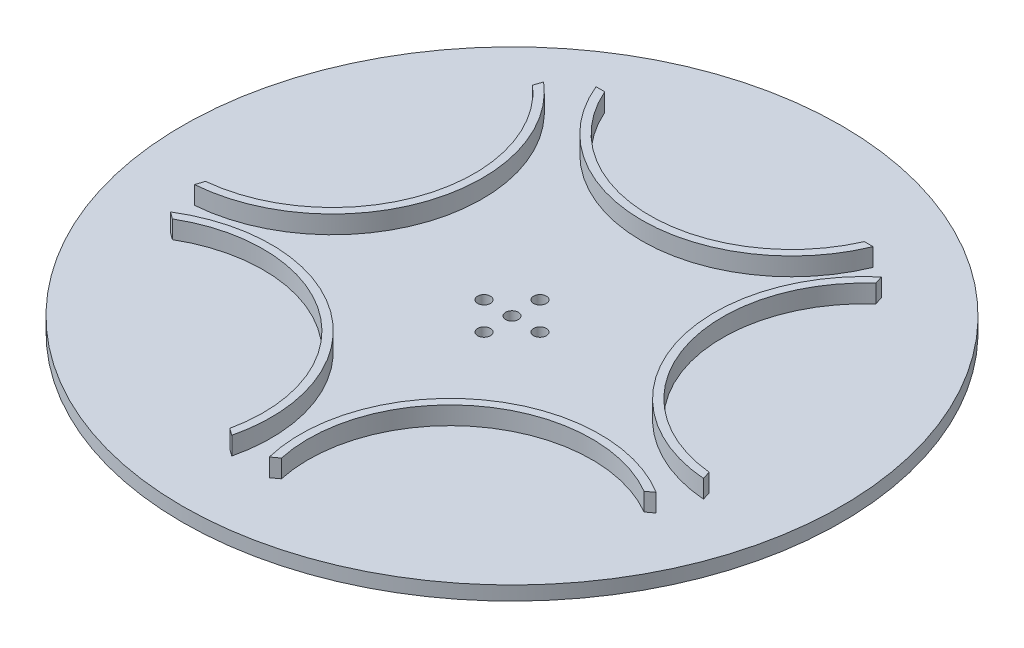
ISO-10303-21;
HEADER;
FILE_DESCRIPTION(('STEP AP214'),'2;1');
FILE_NAME('part.step','',(''),(''),'','','');
FILE_SCHEMA(('AUTOMOTIVE_DESIGN { 1 0 10303 214 1 1 1 1 }'));
ENDSEC;
DATA;
#1=APPLICATION_CONTEXT('core data for automotive mechanical design processes');
#2=APPLICATION_PROTOCOL_DEFINITION('international standard','automotive_design',2000,#1);
#3=PRODUCT_CONTEXT('',#1,'mechanical');
#4=PRODUCT('Part','Part','',(#3));
#5=PRODUCT_RELATED_PRODUCT_CATEGORY('part','',(#4));
#6=PRODUCT_DEFINITION_FORMATION('','',#4);
#7=PRODUCT_DEFINITION_CONTEXT('part definition',#1,'design');
#8=PRODUCT_DEFINITION('design','',#6,#7);
#9=PRODUCT_DEFINITION_SHAPE('','',#8);
#10=(LENGTH_UNIT() NAMED_UNIT(*) SI_UNIT(.MILLI.,.METRE.));
#11=(NAMED_UNIT(*) PLANE_ANGLE_UNIT() SI_UNIT($,.RADIAN.));
#12=(NAMED_UNIT(*) SI_UNIT($,.STERADIAN.) SOLID_ANGLE_UNIT());
#13=UNCERTAINTY_MEASURE_WITH_UNIT(LENGTH_MEASURE(1.E-05),#10,'distance_accuracy_value','');
#14=(GEOMETRIC_REPRESENTATION_CONTEXT(3) GLOBAL_UNCERTAINTY_ASSIGNED_CONTEXT((#13)) GLOBAL_UNIT_ASSIGNED_CONTEXT((#10,
#11,#12)) REPRESENTATION_CONTEXT('',''));
#15=CARTESIAN_POINT('',(0.,0.,0.));
#16=DIRECTION('',(0.,0.,1.));
#17=DIRECTION('',(1.,0.,0.));
#18=AXIS2_PLACEMENT_3D('',#15,#16,#17);
#19=CARTESIAN_POINT('',(0.,3.5,0.));
#20=DIRECTION('',(0.,-1.,0.));
#21=DIRECTION('',(0.,0.,-1.));
#22=AXIS2_PLACEMENT_3D('',#19,#20,#21);
#23=CYLINDRICAL_SURFACE('',#22,82.5);
#24=CARTESIAN_POINT('',(0.,3.5,0.));
#25=DIRECTION('',(0.,1.,0.));
#26=DIRECTION('',(0.,0.,1.));
#27=AXIS2_PLACEMENT_3D('',#24,#25,#26);
#28=CIRCLE('',#27,82.5);
#29=CARTESIAN_POINT('',(0.,3.5,82.5));
#30=VERTEX_POINT('',#29);
#31=EDGE_CURVE('E399',#30,#30,#28,.T.);
#32=ORIENTED_EDGE('',*,*,#31,.F.);
#33=EDGE_LOOP('',(#32));
#34=FACE_BOUND('',#33,.T.);
#35=CARTESIAN_POINT('',(0.,0.,0.));
#36=DIRECTION('',(0.,1.,0.));
#37=DIRECTION('',(0.,0.,1.));
#38=AXIS2_PLACEMENT_3D('',#35,#36,#37);
#39=CIRCLE('',#38,82.5);
#40=CARTESIAN_POINT('',(0.,0.,82.5));
#41=VERTEX_POINT('',#40);
#42=EDGE_CURVE('E387',#41,#41,#39,.T.);
#43=ORIENTED_EDGE('',*,*,#42,.T.);
#44=EDGE_LOOP('',(#43));
#45=FACE_BOUND('',#44,.T.);
#46=ADVANCED_FACE('F129',(#34,#45),#23,.T.);
#47=CARTESIAN_POINT('',(0.,3.5,0.));
#48=DIRECTION('',(0.,-1.,0.));
#49=DIRECTION('',(0.,0.,-1.));
#50=AXIS2_PLACEMENT_3D('',#47,#48,#49);
#51=CYLINDRICAL_SURFACE('',#50,1.6);
#52=CARTESIAN_POINT('',(0.,3.5,0.));
#53=DIRECTION('',(0.,1.,0.));
#54=DIRECTION('',(0.,0.,1.));
#55=AXIS2_PLACEMENT_3D('',#52,#53,#54);
#56=CIRCLE('',#55,1.6);
#57=CARTESIAN_POINT('',(0.,3.5,1.6));
#58=VERTEX_POINT('',#57);
#59=EDGE_CURVE('E396',#58,#58,#56,.T.);
#60=ORIENTED_EDGE('',*,*,#59,.T.);
#61=EDGE_LOOP('',(#60));
#62=FACE_BOUND('',#61,.T.);
#63=CARTESIAN_POINT('',(0.,0.,0.));
#64=DIRECTION('',(0.,1.,0.));
#65=DIRECTION('',(0.,0.,1.));
#66=AXIS2_PLACEMENT_3D('',#63,#64,#65);
#67=CIRCLE('',#66,1.6);
#68=CARTESIAN_POINT('',(0.,0.,1.6));
#69=VERTEX_POINT('',#68);
#70=EDGE_CURVE('E414',#69,#69,#67,.T.);
#71=ORIENTED_EDGE('',*,*,#70,.F.);
#72=EDGE_LOOP('',(#71));
#73=FACE_BOUND('',#72,.T.);
#74=ADVANCED_FACE('F478',(#62,#73),#51,.F.);
#75=CARTESIAN_POINT('',(0.,3.5,-7.));
#76=DIRECTION('',(0.,-1.,0.));
#77=DIRECTION('',(0.,0.,-1.));
#78=AXIS2_PLACEMENT_3D('',#75,#76,#77);
#79=CYLINDRICAL_SURFACE('',#78,1.6);
#80=CARTESIAN_POINT('',(0.,3.5,-7.));
#81=DIRECTION('',(0.,1.,0.));
#82=DIRECTION('',(0.,0.,1.));
#83=AXIS2_PLACEMENT_3D('',#80,#81,#82);
#84=CIRCLE('',#83,1.6);
#85=CARTESIAN_POINT('',(0.,3.5,-5.4));
#86=VERTEX_POINT('',#85);
#87=EDGE_CURVE('E393',#86,#86,#84,.T.);
#88=ORIENTED_EDGE('',*,*,#87,.T.);
#89=EDGE_LOOP('',(#88));
#90=FACE_BOUND('',#89,.T.);
#91=CARTESIAN_POINT('',(0.,0.,-7.));
#92=DIRECTION('',(0.,1.,0.));
#93=DIRECTION('',(0.,0.,1.));
#94=AXIS2_PLACEMENT_3D('',#91,#92,#93);
#95=CIRCLE('',#94,1.6);
#96=CARTESIAN_POINT('',(0.,0.,-5.4));
#97=VERTEX_POINT('',#96);
#98=EDGE_CURVE('E411',#97,#97,#95,.T.);
#99=ORIENTED_EDGE('',*,*,#98,.F.);
#100=EDGE_LOOP('',(#99));
#101=FACE_BOUND('',#100,.T.);
#102=ADVANCED_FACE('F484',(#90,#101),#79,.F.);
#103=CARTESIAN_POINT('',(7.,3.5,0.));
#104=DIRECTION('',(0.,-1.,0.));
#105=DIRECTION('',(0.,0.,-1.));
#106=AXIS2_PLACEMENT_3D('',#103,#104,#105);
#107=CYLINDRICAL_SURFACE('',#106,1.6);
#108=CARTESIAN_POINT('',(7.,3.5,0.));
#109=DIRECTION('',(0.,1.,0.));
#110=DIRECTION('',(0.,0.,1.));
#111=AXIS2_PLACEMENT_3D('',#108,#109,#110);
#112=CIRCLE('',#111,1.6);
#113=CARTESIAN_POINT('',(7.,3.5,1.6));
#114=VERTEX_POINT('',#113);
#115=EDGE_CURVE('E390',#114,#114,#112,.T.);
#116=ORIENTED_EDGE('',*,*,#115,.T.);
#117=EDGE_LOOP('',(#116));
#118=FACE_BOUND('',#117,.T.);
#119=CARTESIAN_POINT('',(7.,0.,0.));
#120=DIRECTION('',(0.,1.,0.));
#121=DIRECTION('',(0.,0.,1.));
#122=AXIS2_PLACEMENT_3D('',#119,#120,#121);
#123=CIRCLE('',#122,1.6);
#124=CARTESIAN_POINT('',(7.,0.,1.6));
#125=VERTEX_POINT('',#124);
#126=EDGE_CURVE('E408',#125,#125,#123,.T.);
#127=ORIENTED_EDGE('',*,*,#126,.F.);
#128=EDGE_LOOP('',(#127));
#129=FACE_BOUND('',#128,.T.);
#130=ADVANCED_FACE('F495',(#118,#129),#107,.F.);
#131=CARTESIAN_POINT('',(0.,3.5,7.));
#132=DIRECTION('',(0.,-1.,0.));
#133=DIRECTION('',(0.,0.,-1.));
#134=AXIS2_PLACEMENT_3D('',#131,#132,#133);
#135=CYLINDRICAL_SURFACE('',#134,1.6);
#136=CARTESIAN_POINT('',(0.,3.5,7.));
#137=DIRECTION('',(0.,1.,0.));
#138=DIRECTION('',(0.,0.,1.));
#139=AXIS2_PLACEMENT_3D('',#136,#137,#138);
#140=CIRCLE('',#139,1.6);
#141=CARTESIAN_POINT('',(0.,3.5,8.6));
#142=VERTEX_POINT('',#141);
#143=EDGE_CURVE('E386',#142,#142,#140,.T.);
#144=ORIENTED_EDGE('',*,*,#143,.T.);
#145=EDGE_LOOP('',(#144));
#146=FACE_BOUND('',#145,.T.);
#147=CARTESIAN_POINT('',(0.,0.,7.));
#148=DIRECTION('',(0.,1.,0.));
#149=DIRECTION('',(0.,0.,1.));
#150=AXIS2_PLACEMENT_3D('',#147,#148,#149);
#151=CIRCLE('',#150,1.6);
#152=CARTESIAN_POINT('',(0.,0.,8.6));
#153=VERTEX_POINT('',#152);
#154=EDGE_CURVE('E405',#153,#153,#151,.T.);
#155=ORIENTED_EDGE('',*,*,#154,.F.);
#156=EDGE_LOOP('',(#155));
#157=FACE_BOUND('',#156,.T.);
#158=ADVANCED_FACE('F498',(#146,#157),#135,.F.);
#159=CARTESIAN_POINT('',(-7.,3.5,0.));
#160=DIRECTION('',(0.,-1.,0.));
#161=DIRECTION('',(0.,0.,-1.));
#162=AXIS2_PLACEMENT_3D('',#159,#160,#161);
#163=CYLINDRICAL_SURFACE('',#162,1.6);
#164=CARTESIAN_POINT('',(-7.,3.5,0.));
#165=DIRECTION('',(0.,1.,0.));
#166=DIRECTION('',(0.,0.,1.));
#167=AXIS2_PLACEMENT_3D('',#164,#165,#166);
#168=CIRCLE('',#167,1.6);
#169=CARTESIAN_POINT('',(-7.,3.5,1.6));
#170=VERTEX_POINT('',#169);
#171=EDGE_CURVE('E383',#170,#170,#168,.T.);
#172=ORIENTED_EDGE('',*,*,#171,.T.);
#173=EDGE_LOOP('',(#172));
#174=FACE_BOUND('',#173,.T.);
#175=CARTESIAN_POINT('',(-7.,0.,0.));
#176=DIRECTION('',(0.,1.,0.));
#177=DIRECTION('',(0.,0.,1.));
#178=AXIS2_PLACEMENT_3D('',#175,#176,#177);
#179=CIRCLE('',#178,1.6);
#180=CARTESIAN_POINT('',(-7.,0.,1.6));
#181=VERTEX_POINT('',#180);
#182=EDGE_CURVE('E382',#181,#181,#179,.T.);
#183=ORIENTED_EDGE('',*,*,#182,.F.);
#184=EDGE_LOOP('',(#183));
#185=FACE_BOUND('',#184,.T.);
#186=ADVANCED_FACE('F131',(#174,#185),#163,.F.);
#187=CARTESIAN_POINT('',(0.,0.,0.));
#188=DIRECTION('',(0.,1.,0.));
#189=DIRECTION('',(0.,0.,1.));
#190=AXIS2_PLACEMENT_3D('',#187,#188,#189);
#191=PLANE('',#190);
#192=ORIENTED_EDGE('',*,*,#182,.T.);
#193=EDGE_LOOP('',(#192));
#194=FACE_BOUND('',#193,.T.);
#195=ORIENTED_EDGE('',*,*,#154,.T.);
#196=EDGE_LOOP('',(#195));
#197=FACE_BOUND('',#196,.T.);
#198=ORIENTED_EDGE('',*,*,#126,.T.);
#199=EDGE_LOOP('',(#198));
#200=FACE_BOUND('',#199,.T.);
#201=ORIENTED_EDGE('',*,*,#98,.T.);
#202=EDGE_LOOP('',(#201));
#203=FACE_BOUND('',#202,.T.);
#204=ORIENTED_EDGE('',*,*,#70,.T.);
#205=EDGE_LOOP('',(#204));
#206=FACE_BOUND('',#205,.T.);
#207=ORIENTED_EDGE('',*,*,#42,.F.);
#208=EDGE_LOOP('',(#207));
#209=FACE_BOUND('',#208,.T.);
#210=ADVANCED_FACE('F490',(#194,#197,#200,#203,#206,#209),#191,.F.);
#211=CARTESIAN_POINT('',(0.,3.5,0.));
#212=DIRECTION('',(0.,1.,0.));
#213=DIRECTION('',(0.,0.,1.));
#214=AXIS2_PLACEMENT_3D('',#211,#212,#213);
#215=PLANE('',#214);
#216=CARTESIAN_POINT('',(0.,3.5,-70.));
#217=DIRECTION('',(0.,1.,0.));
#218=DIRECTION('',(0.,0.,1.));
#219=AXIS2_PLACEMENT_3D('',#216,#217,#218);
#220=CIRCLE('',#219,37.5);
#221=CARTESIAN_POINT('',(34.6734768951716,3.5,-55.7171431429143));
#222=VERTEX_POINT('',#221);
#223=CARTESIAN_POINT('',(-34.6734768951716,3.5,-55.7171431429144));
#224=VERTEX_POINT('',#223);
#225=EDGE_CURVE('E137',#222,#224,#220,.F.);
#226=ORIENTED_EDGE('',*,*,#225,.T.);
#227=DIRECTION('',(1.,0.,0.));
#228=VECTOR('',#227,1.);
#229=CARTESIAN_POINT('',(0.,3.5,-55.7171431429143));
#230=LINE('',#229,#228);
#231=CARTESIAN_POINT('',(-32.5,3.5,-55.7171431429143));
#232=VERTEX_POINT('',#231);
#233=EDGE_CURVE('E12',#224,#232,#230,.T.);
#234=ORIENTED_EDGE('',*,*,#233,.T.);
#235=CARTESIAN_POINT('',(0.,3.5,-70.));
#236=DIRECTION('',(0.,1.,0.));
#237=DIRECTION('',(0.,0.,1.));
#238=AXIS2_PLACEMENT_3D('',#235,#236,#237);
#239=CIRCLE('',#238,35.5);
#240=CARTESIAN_POINT('',(32.5,3.5,-55.7171431429143));
#241=VERTEX_POINT('',#240);
#242=EDGE_CURVE('E269',#241,#232,#239,.F.);
#243=ORIENTED_EDGE('',*,*,#242,.F.);
#244=DIRECTION('',(-1.,0.,0.));
#245=VECTOR('',#244,1.);
#246=CARTESIAN_POINT('',(0.,3.5,-55.7171431429143));
#247=LINE('',#246,#245);
#248=EDGE_CURVE('E147',#222,#241,#247,.T.);
#249=ORIENTED_EDGE('',*,*,#248,.F.);
#250=EDGE_LOOP('',(#226,#234,#243,#249));
#251=FACE_BOUND('',#250,.T.);
#252=CARTESIAN_POINT('',(66.5739561406615,3.5,-21.6311896062442));
#253=DIRECTION('',(0.,1.,0.));
#254=DIRECTION('',(0.,0.,1.));
#255=AXIS2_PLACEMENT_3D('',#252,#253,#254);
#256=CIRCLE('',#255,37.5);
#257=CARTESIAN_POINT('',(63.7048456700931,3.5,15.7588920345824));
#258=VERTEX_POINT('',#257);
#259=CARTESIAN_POINT('',(42.275458440745,3.5,-50.1939802529432));
#260=VERTEX_POINT('',#259);
#261=EDGE_CURVE('E454',#258,#260,#256,.F.);
#262=ORIENTED_EDGE('',*,*,#261,.T.);
#263=DIRECTION('',(0.309016994374918,0.,0.951056516295163));
#264=VECTOR('',#263,1.);
#265=CARTESIAN_POINT('',(52.9901520554191,3.5,-17.2175441091805));
#266=LINE('',#265,#264);
#267=CARTESIAN_POINT('',(42.9470997382343,3.5,-48.1268808887732));
#268=VERTEX_POINT('',#267);
#269=EDGE_CURVE('E456',#260,#268,#266,.T.);
#270=ORIENTED_EDGE('',*,*,#269,.T.);
#271=CARTESIAN_POINT('',(66.5739561406615,3.5,-21.6311896062442));
#272=DIRECTION('',(0.,1.,0.));
#273=DIRECTION('',(0.,0.,1.));
#274=AXIS2_PLACEMENT_3D('',#271,#272,#273);
#275=CIRCLE('',#274,35.5);
#276=CARTESIAN_POINT('',(63.0332043726039,3.5,13.6917926704124));
#277=VERTEX_POINT('',#276);
#278=EDGE_CURVE('E448',#277,#268,#275,.F.);
#279=ORIENTED_EDGE('',*,*,#278,.F.);
#280=DIRECTION('',(-0.309016994374915,0.,-0.951056516295164));
#281=VECTOR('',#280,1.);
#282=CARTESIAN_POINT('',(52.9901520554192,3.5,-17.2175441091803));
#283=LINE('',#282,#281);
#284=EDGE_CURVE('E451',#258,#277,#283,.T.);
#285=ORIENTED_EDGE('',*,*,#284,.F.);
#286=EDGE_LOOP('',(#262,#270,#279,#285));
#287=FACE_BOUND('',#286,.T.);
#288=CARTESIAN_POINT('',(-41.1449676604785,3.5,56.6311896062424));
#289=DIRECTION('',(0.,1.,0.));
#290=DIRECTION('',(0.,0.,1.));
#291=AXIS2_PLACEMENT_3D('',#288,#289,#290);
#292=CIRCLE('',#291,37.5);
#293=CARTESIAN_POINT('',(-60.801147101537,3.5,24.6955573159478));
#294=VERTEX_POINT('',#293);
#295=CARTESIAN_POINT('',(-4.69828297701909,3.5,65.4566740453245));
#296=VERTEX_POINT('',#295);
#297=EDGE_CURVE('E444',#294,#296,#292,.F.);
#298=ORIENTED_EDGE('',*,*,#297,.T.);
#299=DIRECTION('',(-0.809016994374889,0.,-0.587785252292554));
#300=VECTOR('',#299,1.);
#301=CARTESIAN_POINT('',(-32.7497150392781,3.5,45.0761156806359));
#302=LINE('',#301,#300);
#303=CARTESIAN_POINT('',(-6.4566627220941,3.5,64.179136380144));
#304=VERTEX_POINT('',#303);
#305=EDGE_CURVE('E446',#296,#304,#302,.T.);
#306=ORIENTED_EDGE('',*,*,#305,.T.);
#307=CARTESIAN_POINT('',(-41.1449676604785,3.5,56.6311896062424));
#308=DIRECTION('',(0.,1.,0.));
#309=DIRECTION('',(0.,0.,1.));
#310=AXIS2_PLACEMENT_3D('',#307,#308,#309);
#311=CIRCLE('',#310,35.5);
#312=CARTESIAN_POINT('',(-59.042767356462,3.5,25.9730949811282));
#313=VERTEX_POINT('',#312);
#314=EDGE_CURVE('E438',#313,#304,#311,.F.);
#315=ORIENTED_EDGE('',*,*,#314,.F.);
#316=DIRECTION('',(0.80901699437489,0.,0.587785252292552));
#317=VECTOR('',#316,1.);
#318=CARTESIAN_POINT('',(-32.7497150392782,3.5,45.0761156806361));
#319=LINE('',#318,#317);
#320=EDGE_CURVE('E441',#294,#313,#319,.T.);
#321=ORIENTED_EDGE('',*,*,#320,.F.);
#322=EDGE_LOOP('',(#298,#306,#315,#321));
#323=FACE_BOUND('',#322,.T.);
#324=CARTESIAN_POINT('',(-66.573956140658,3.5,-21.6311896062548));
#325=DIRECTION('',(0.,1.,0.));
#326=DIRECTION('',(0.,0.,1.));
#327=AXIS2_PLACEMENT_3D('',#324,#325,#326);
#328=CIRCLE('',#327,37.5);
#329=CARTESIAN_POINT('',(-42.275458440737,3.5,-50.1939802529499));
#330=VERTEX_POINT('',#329);
#331=CARTESIAN_POINT('',(-63.7048456700956,3.5,15.7588920345722));
#332=VERTEX_POINT('',#331);
#333=EDGE_CURVE('E434',#330,#332,#328,.F.);
#334=ORIENTED_EDGE('',*,*,#333,.T.);
#335=DIRECTION('',(0.309016994375062,0.,-0.951056516295116));
#336=VECTOR('',#335,1.);
#337=CARTESIAN_POINT('',(-52.9901520554166,3.5,-17.2175441091886));
#338=LINE('',#337,#336);
#339=CARTESIAN_POINT('',(-63.0332043726061,3.5,13.6917926704024));
#340=VERTEX_POINT('',#339);
#341=EDGE_CURVE('E436',#332,#340,#338,.T.);
#342=ORIENTED_EDGE('',*,*,#341,.T.);
#343=CARTESIAN_POINT('',(-66.573956140658,3.5,-21.6311896062548));
#344=DIRECTION('',(0.,1.,0.));
#345=DIRECTION('',(0.,0.,1.));
#346=AXIS2_PLACEMENT_3D('',#343,#344,#345);
#347=CIRCLE('',#346,35.5);
#348=CARTESIAN_POINT('',(-42.9470997382266,3.5,-48.1268808887801));
#349=VERTEX_POINT('',#348);
#350=EDGE_CURVE('E428',#349,#340,#347,.F.);
#351=ORIENTED_EDGE('',*,*,#350,.F.);
#352=DIRECTION('',(-0.309016994375071,0.,0.951056516295113));
#353=VECTOR('',#352,1.);
#354=CARTESIAN_POINT('',(-52.9901520554163,3.5,-17.217544109189));
#355=LINE('',#354,#353);
#356=EDGE_CURVE('E431',#330,#349,#355,.T.);
#357=ORIENTED_EDGE('',*,*,#356,.F.);
#358=EDGE_LOOP('',(#334,#342,#351,#357));
#359=FACE_BOUND('',#358,.T.);
#360=CARTESIAN_POINT('',(41.1449676604695,3.5,56.631189606249));
#361=DIRECTION('',(0.,1.,0.));
#362=DIRECTION('',(0.,0.,1.));
#363=AXIS2_PLACEMENT_3D('',#360,#361,#362);
#364=CIRCLE('',#363,35.5);
#365=CARTESIAN_POINT('',(6.45666272208386,3.5,64.1791363801451));
#366=VERTEX_POINT('',#365);
#367=CARTESIAN_POINT('',(59.0427673564579,3.5,25.9730949811377));
#368=VERTEX_POINT('',#367);
#369=EDGE_CURVE('E425',#366,#368,#364,.F.);
#370=ORIENTED_EDGE('',*,*,#369,.F.);
#371=DIRECTION('',(0.809016994374988,0.,-0.587785252292417));
#372=VECTOR('',#371,1.);
#373=CARTESIAN_POINT('',(32.7497150392707,3.5,45.0761156806417));
#374=LINE('',#373,#372);
#375=CARTESIAN_POINT('',(4.69828297700864,3.5,65.4566740453253));
#376=VERTEX_POINT('',#375);
#377=EDGE_CURVE('E402',#376,#366,#374,.T.);
#378=ORIENTED_EDGE('',*,*,#377,.F.);
#379=CARTESIAN_POINT('',(41.1449676604695,3.5,56.631189606249));
#380=DIRECTION('',(0.,1.,0.));
#381=DIRECTION('',(0.,0.,1.));
#382=AXIS2_PLACEMENT_3D('',#379,#380,#381);
#383=CIRCLE('',#382,37.5);
#384=CARTESIAN_POINT('',(60.8011471015331,3.5,24.6955573159575));
#385=VERTEX_POINT('',#384);
#386=EDGE_CURVE('E421',#376,#385,#383,.F.);
#387=ORIENTED_EDGE('',*,*,#386,.T.);
#388=DIRECTION('',(-0.809016994374985,0.,0.587785252292422));
#389=VECTOR('',#388,1.);
#390=CARTESIAN_POINT('',(32.7497150392709,3.5,45.0761156806414));
#391=LINE('',#390,#389);
#392=EDGE_CURVE('E423',#385,#368,#391,.T.);
#393=ORIENTED_EDGE('',*,*,#392,.T.);
#394=EDGE_LOOP('',(#370,#378,#387,#393));
#395=FACE_BOUND('',#394,.T.);
#396=ORIENTED_EDGE('',*,*,#171,.F.);
#397=EDGE_LOOP('',(#396));
#398=FACE_BOUND('',#397,.T.);
#399=ORIENTED_EDGE('',*,*,#143,.F.);
#400=EDGE_LOOP('',(#399));
#401=FACE_BOUND('',#400,.T.);
#402=ORIENTED_EDGE('',*,*,#115,.F.);
#403=EDGE_LOOP('',(#402));
#404=FACE_BOUND('',#403,.T.);
#405=ORIENTED_EDGE('',*,*,#87,.F.);
#406=EDGE_LOOP('',(#405));
#407=FACE_BOUND('',#406,.T.);
#408=ORIENTED_EDGE('',*,*,#59,.F.);
#409=EDGE_LOOP('',(#408));
#410=FACE_BOUND('',#409,.T.);
#411=ORIENTED_EDGE('',*,*,#31,.T.);
#412=EDGE_LOOP('',(#411));
#413=FACE_BOUND('',#412,.T.);
#414=ADVANCED_FACE('F512',(#251,#287,#323,#359,#395,#398,#401,#404,#407,#410,#413),#215,.T.);
#415=CARTESIAN_POINT('',(41.1449676604695,8.,56.631189606249));
#416=DIRECTION('',(0.,-1.,0.));
#417=DIRECTION('',(0.,0.,-1.));
#418=AXIS2_PLACEMENT_3D('',#415,#416,#417);
#419=CYLINDRICAL_SURFACE('',#418,35.5);
#420=DIRECTION('',(0.,-1.,0.));
#421=VECTOR('',#420,1.);
#422=CARTESIAN_POINT('',(6.45666272208386,8.,64.1791363801451));
#423=LINE('',#422,#421);
#424=CARTESIAN_POINT('',(6.45666272208386,8.,64.1791363801451));
#425=VERTEX_POINT('',#424);
#426=EDGE_CURVE('E370',#425,#366,#423,.T.);
#427=ORIENTED_EDGE('',*,*,#426,.T.);
#428=ORIENTED_EDGE('',*,*,#369,.T.);
#429=DIRECTION('',(0.,-1.,0.));
#430=VECTOR('',#429,1.);
#431=CARTESIAN_POINT('',(59.0427673564579,8.,25.9730949811377));
#432=LINE('',#431,#430);
#433=CARTESIAN_POINT('',(59.0427673564579,8.,25.9730949811377));
#434=VERTEX_POINT('',#433);
#435=EDGE_CURVE('E379',#434,#368,#432,.T.);
#436=ORIENTED_EDGE('',*,*,#435,.F.);
#437=CARTESIAN_POINT('',(41.1449676604695,8.,56.631189606249));
#438=DIRECTION('',(0.,1.,0.));
#439=DIRECTION('',(0.,0.,1.));
#440=AXIS2_PLACEMENT_3D('',#437,#438,#439);
#441=CIRCLE('',#440,35.5);
#442=EDGE_CURVE('E360',#434,#425,#441,.T.);
#443=ORIENTED_EDGE('',*,*,#442,.T.);
#444=EDGE_LOOP('',(#427,#428,#436,#443));
#445=FACE_BOUND('',#444,.T.);
#446=ADVANCED_FACE('F527',(#445),#419,.F.);
#447=CARTESIAN_POINT('',(32.7497150392709,8.,45.0761156806414));
#448=DIRECTION('',(-0.587785252292422,0.,-0.809016994374985));
#449=DIRECTION('',(-0.809016994374985,0.,0.587785252292422));
#450=AXIS2_PLACEMENT_3D('',#447,#448,#449);
#451=PLANE('',#450);
#452=ORIENTED_EDGE('',*,*,#392,.F.);
#453=DIRECTION('',(0.,-1.,0.));
#454=VECTOR('',#453,1.);
#455=CARTESIAN_POINT('',(60.8011471015331,8.,24.6955573159575));
#456=LINE('',#455,#454);
#457=CARTESIAN_POINT('',(60.8011471015331,8.,24.6955573159575));
#458=VERTEX_POINT('',#457);
#459=EDGE_CURVE('E376',#458,#385,#456,.T.);
#460=ORIENTED_EDGE('',*,*,#459,.F.);
#461=DIRECTION('',(0.809016994374985,0.,-0.587785252292422));
#462=VECTOR('',#461,1.);
#463=CARTESIAN_POINT('',(32.7497150392709,8.,45.0761156806414));
#464=LINE('',#463,#462);
#465=EDGE_CURVE('E363',#434,#458,#464,.T.);
#466=ORIENTED_EDGE('',*,*,#465,.F.);
#467=ORIENTED_EDGE('',*,*,#435,.T.);
#468=EDGE_LOOP('',(#452,#460,#466,#467));
#469=FACE_BOUND('',#468,.T.);
#470=ADVANCED_FACE('F533',(#469),#451,.F.);
#471=CARTESIAN_POINT('',(41.1449676604695,8.,56.631189606249));
#472=DIRECTION('',(0.,-1.,0.));
#473=DIRECTION('',(0.,0.,-1.));
#474=AXIS2_PLACEMENT_3D('',#471,#472,#473);
#475=CYLINDRICAL_SURFACE('',#474,37.5);
#476=ORIENTED_EDGE('',*,*,#386,.F.);
#477=DIRECTION('',(0.,-1.,0.));
#478=VECTOR('',#477,1.);
#479=CARTESIAN_POINT('',(4.69828297700865,8.,65.4566740453252));
#480=LINE('',#479,#478);
#481=CARTESIAN_POINT('',(4.69828297700865,8.,65.4566740453252));
#482=VERTEX_POINT('',#481);
#483=EDGE_CURVE('E373',#482,#376,#480,.T.);
#484=ORIENTED_EDGE('',*,*,#483,.F.);
#485=CARTESIAN_POINT('',(41.1449676604695,8.,56.631189606249));
#486=DIRECTION('',(0.,1.,0.));
#487=DIRECTION('',(0.,0.,1.));
#488=AXIS2_PLACEMENT_3D('',#485,#486,#487);
#489=CIRCLE('',#488,37.5);
#490=EDGE_CURVE('E365',#458,#482,#489,.T.);
#491=ORIENTED_EDGE('',*,*,#490,.F.);
#492=ORIENTED_EDGE('',*,*,#459,.T.);
#493=EDGE_LOOP('',(#476,#484,#491,#492));
#494=FACE_BOUND('',#493,.T.);
#495=ADVANCED_FACE('F540',(#494),#475,.T.);
#496=CARTESIAN_POINT('',(32.7497150392707,8.,45.0761156806417));
#497=DIRECTION('',(0.587785252292417,0.,0.809016994374988));
#498=DIRECTION('',(0.809016994374988,0.,-0.587785252292417));
#499=AXIS2_PLACEMENT_3D('',#496,#497,#498);
#500=PLANE('',#499);
#501=ORIENTED_EDGE('',*,*,#483,.T.);
#502=ORIENTED_EDGE('',*,*,#377,.T.);
#503=ORIENTED_EDGE('',*,*,#426,.F.);
#504=DIRECTION('',(-0.809016994374988,0.,0.587785252292417));
#505=VECTOR('',#504,1.);
#506=CARTESIAN_POINT('',(32.7497150392707,8.,45.0761156806417));
#507=LINE('',#506,#505);
#508=EDGE_CURVE('E367',#425,#482,#507,.T.);
#509=ORIENTED_EDGE('',*,*,#508,.T.);
#510=EDGE_LOOP('',(#501,#502,#503,#509));
#511=FACE_BOUND('',#510,.T.);
#512=ADVANCED_FACE('F544',(#511),#500,.T.);
#513=CARTESIAN_POINT('',(0.,8.,0.));
#514=DIRECTION('',(0.,1.,0.));
#515=DIRECTION('',(0.,0.,1.));
#516=AXIS2_PLACEMENT_3D('',#513,#514,#515);
#517=PLANE('',#516);
#518=ORIENTED_EDGE('',*,*,#442,.F.);
#519=ORIENTED_EDGE('',*,*,#465,.T.);
#520=ORIENTED_EDGE('',*,*,#490,.T.);
#521=ORIENTED_EDGE('',*,*,#508,.F.);
#522=EDGE_LOOP('',(#518,#519,#520,#521));
#523=FACE_BOUND('',#522,.T.);
#524=ADVANCED_FACE('F548',(#523),#517,.T.);
#525=CARTESIAN_POINT('',(-63.0332043726061,8.,13.6917926704024));
#526=DIRECTION('',(0.951056516295116,0.,0.309016994375062));
#527=DIRECTION('',(0.309016994375062,0.,-0.951056516295116));
#528=AXIS2_PLACEMENT_3D('',#525,#526,#527);
#529=PLANE('',#528);
#530=ORIENTED_EDGE('',*,*,#341,.F.);
#531=DIRECTION('',(0.,-1.,0.));
#532=VECTOR('',#531,1.);
#533=CARTESIAN_POINT('',(-63.7048456700956,8.,15.7588920345722));
#534=LINE('',#533,#532);
#535=CARTESIAN_POINT('',(-63.7048456700956,8.,15.7588920345722));
#536=VERTEX_POINT('',#535);
#537=EDGE_CURVE('E337',#536,#332,#534,.T.);
#538=ORIENTED_EDGE('',*,*,#537,.F.);
#539=DIRECTION('',(-0.309016994375062,0.,0.951056516295116));
#540=VECTOR('',#539,1.);
#541=CARTESIAN_POINT('',(-63.0332043726061,8.,13.6917926704024));
#542=LINE('',#541,#540);
#543=CARTESIAN_POINT('',(-63.0332043726061,8.,13.6917926704024));
#544=VERTEX_POINT('',#543);
#545=EDGE_CURVE('E357',#544,#536,#542,.T.);
#546=ORIENTED_EDGE('',*,*,#545,.F.);
#547=DIRECTION('',(0.,-1.,0.));
#548=VECTOR('',#547,1.);
#549=CARTESIAN_POINT('',(-63.0332043726061,8.,13.6917926704024));
#550=LINE('',#549,#548);
#551=EDGE_CURVE('E346',#544,#340,#550,.T.);
#552=ORIENTED_EDGE('',*,*,#551,.T.);
#553=EDGE_LOOP('',(#530,#538,#546,#552));
#554=FACE_BOUND('',#553,.T.);
#555=ADVANCED_FACE('F552',(#554),#529,.F.);
#556=CARTESIAN_POINT('',(-66.573956140658,8.,-21.6311896062548));
#557=DIRECTION('',(0.,-1.,0.));
#558=DIRECTION('',(0.,0.,-1.));
#559=AXIS2_PLACEMENT_3D('',#556,#557,#558);
#560=CYLINDRICAL_SURFACE('',#559,37.5);
#561=ORIENTED_EDGE('',*,*,#333,.F.);
#562=DIRECTION('',(0.,-1.,0.));
#563=VECTOR('',#562,1.);
#564=CARTESIAN_POINT('',(-42.275458440737,8.,-50.1939802529499));
#565=LINE('',#564,#563);
#566=CARTESIAN_POINT('',(-42.275458440737,8.,-50.1939802529499));
#567=VERTEX_POINT('',#566);
#568=EDGE_CURVE('E340',#567,#330,#565,.T.);
#569=ORIENTED_EDGE('',*,*,#568,.F.);
#570=CARTESIAN_POINT('',(-66.573956140658,8.,-21.6311896062548));
#571=DIRECTION('',(0.,1.,0.));
#572=DIRECTION('',(0.,0.,1.));
#573=AXIS2_PLACEMENT_3D('',#570,#571,#572);
#574=CIRCLE('',#573,37.5);
#575=EDGE_CURVE('E355',#536,#567,#574,.T.);
#576=ORIENTED_EDGE('',*,*,#575,.F.);
#577=ORIENTED_EDGE('',*,*,#537,.T.);
#578=EDGE_LOOP('',(#561,#569,#576,#577));
#579=FACE_BOUND('',#578,.T.);
#580=ADVANCED_FACE('F566',(#579),#560,.T.);
#581=CARTESIAN_POINT('',(-42.9470997382266,8.,-48.1268808887801));
#582=DIRECTION('',(-0.951056516295113,0.,-0.309016994375071));
#583=DIRECTION('',(-0.309016994375071,0.,0.951056516295113));
#584=AXIS2_PLACEMENT_3D('',#581,#582,#583);
#585=PLANE('',#584);
#586=ORIENTED_EDGE('',*,*,#568,.T.);
#587=ORIENTED_EDGE('',*,*,#356,.T.);
#588=DIRECTION('',(0.,-1.,0.));
#589=VECTOR('',#588,1.);
#590=CARTESIAN_POINT('',(-42.9470997382266,8.,-48.1268808887801));
#591=LINE('',#590,#589);
#592=CARTESIAN_POINT('',(-42.9470997382266,8.,-48.1268808887801));
#593=VERTEX_POINT('',#592);
#594=EDGE_CURVE('E343',#593,#349,#591,.T.);
#595=ORIENTED_EDGE('',*,*,#594,.F.);
#596=DIRECTION('',(0.309016994375071,0.,-0.951056516295113));
#597=VECTOR('',#596,1.);
#598=CARTESIAN_POINT('',(-42.9470997382266,8.,-48.1268808887801));
#599=LINE('',#598,#597);
#600=EDGE_CURVE('E352',#593,#567,#599,.T.);
#601=ORIENTED_EDGE('',*,*,#600,.T.);
#602=EDGE_LOOP('',(#586,#587,#595,#601));
#603=FACE_BOUND('',#602,.T.);
#604=ADVANCED_FACE('F562',(#603),#585,.T.);
#605=CARTESIAN_POINT('',(-66.573956140658,8.,-21.6311896062548));
#606=DIRECTION('',(0.,-1.,0.));
#607=DIRECTION('',(0.,0.,-1.));
#608=AXIS2_PLACEMENT_3D('',#605,#606,#607);
#609=CYLINDRICAL_SURFACE('',#608,35.5);
#610=ORIENTED_EDGE('',*,*,#594,.T.);
#611=ORIENTED_EDGE('',*,*,#350,.T.);
#612=ORIENTED_EDGE('',*,*,#551,.F.);
#613=CARTESIAN_POINT('',(-66.573956140658,8.,-21.6311896062548));
#614=DIRECTION('',(0.,1.,0.));
#615=DIRECTION('',(0.,0.,1.));
#616=AXIS2_PLACEMENT_3D('',#613,#614,#615);
#617=CIRCLE('',#616,35.5);
#618=EDGE_CURVE('E349',#544,#593,#617,.T.);
#619=ORIENTED_EDGE('',*,*,#618,.T.);
#620=EDGE_LOOP('',(#610,#611,#612,#619));
#621=FACE_BOUND('',#620,.T.);
#622=ADVANCED_FACE('F558',(#621),#609,.F.);
#623=CARTESIAN_POINT('',(-66.573956140658,8.,-21.6311896062548));
#624=DIRECTION('',(0.,1.,0.));
#625=DIRECTION('',(0.,0.,1.));
#626=AXIS2_PLACEMENT_3D('',#623,#624,#625);
#627=PLANE('',#626);
#628=ORIENTED_EDGE('',*,*,#545,.T.);
#629=ORIENTED_EDGE('',*,*,#575,.T.);
#630=ORIENTED_EDGE('',*,*,#600,.F.);
#631=ORIENTED_EDGE('',*,*,#618,.F.);
#632=EDGE_LOOP('',(#628,#629,#630,#631));
#633=FACE_BOUND('',#632,.T.);
#634=ADVANCED_FACE('F554',(#633),#627,.T.);
#635=CARTESIAN_POINT('',(-6.45666272209409,8.,64.179136380144));
#636=DIRECTION('',(0.587785252292553,0.,-0.809016994374889));
#637=DIRECTION('',(-0.809016994374889,0.,-0.587785252292554));
#638=AXIS2_PLACEMENT_3D('',#635,#636,#637);
#639=PLANE('',#638);
#640=ORIENTED_EDGE('',*,*,#305,.F.);
#641=DIRECTION('',(0.,-1.,0.));
#642=VECTOR('',#641,1.);
#643=CARTESIAN_POINT('',(-4.69828297701909,8.,65.4566740453245));
#644=LINE('',#643,#642);
#645=CARTESIAN_POINT('',(-4.69828297701909,8.,65.4566740453245));
#646=VERTEX_POINT('',#645);
#647=EDGE_CURVE('E314',#646,#296,#644,.T.);
#648=ORIENTED_EDGE('',*,*,#647,.F.);
#649=DIRECTION('',(0.809016994374889,0.,0.587785252292553));
#650=VECTOR('',#649,1.);
#651=CARTESIAN_POINT('',(-6.45666272209409,8.,64.179136380144));
#652=LINE('',#651,#650);
#653=CARTESIAN_POINT('',(-6.4566627220941,8.,64.179136380144));
#654=VERTEX_POINT('',#653);
#655=EDGE_CURVE('E334',#654,#646,#652,.T.);
#656=ORIENTED_EDGE('',*,*,#655,.F.);
#657=DIRECTION('',(0.,-1.,0.));
#658=VECTOR('',#657,1.);
#659=CARTESIAN_POINT('',(-6.4566627220941,8.,64.179136380144));
#660=LINE('',#659,#658);
#661=EDGE_CURVE('E323',#654,#304,#660,.T.);
#662=ORIENTED_EDGE('',*,*,#661,.T.);
#663=EDGE_LOOP('',(#640,#648,#656,#662));
#664=FACE_BOUND('',#663,.T.);
#665=ADVANCED_FACE('F557',(#664),#639,.F.);
#666=CARTESIAN_POINT('',(-41.1449676604785,8.,56.6311896062424));
#667=DIRECTION('',(0.,-1.,0.));
#668=DIRECTION('',(0.,0.,-1.));
#669=AXIS2_PLACEMENT_3D('',#666,#667,#668);
#670=CYLINDRICAL_SURFACE('',#669,37.5);
#671=ORIENTED_EDGE('',*,*,#297,.F.);
#672=DIRECTION('',(0.,-1.,0.));
#673=VECTOR('',#672,1.);
#674=CARTESIAN_POINT('',(-60.801147101537,8.,24.6955573159478));
#675=LINE('',#674,#673);
#676=CARTESIAN_POINT('',(-60.801147101537,8.,24.6955573159478));
#677=VERTEX_POINT('',#676);
#678=EDGE_CURVE('E317',#677,#294,#675,.T.);
#679=ORIENTED_EDGE('',*,*,#678,.F.);
#680=CARTESIAN_POINT('',(-41.1449676604785,8.,56.6311896062424));
#681=DIRECTION('',(0.,1.,0.));
#682=DIRECTION('',(0.,0.,1.));
#683=AXIS2_PLACEMENT_3D('',#680,#681,#682);
#684=CIRCLE('',#683,37.5);
#685=EDGE_CURVE('E332',#646,#677,#684,.T.);
#686=ORIENTED_EDGE('',*,*,#685,.F.);
#687=ORIENTED_EDGE('',*,*,#647,.T.);
#688=EDGE_LOOP('',(#671,#679,#686,#687));
#689=FACE_BOUND('',#688,.T.);
#690=ADVANCED_FACE('F586',(#689),#670,.T.);
#691=CARTESIAN_POINT('',(-59.042767356462,8.,25.9730949811282));
#692=DIRECTION('',(-0.587785252292552,0.,0.80901699437489));
#693=DIRECTION('',(0.80901699437489,0.,0.587785252292552));
#694=AXIS2_PLACEMENT_3D('',#691,#692,#693);
#695=PLANE('',#694);
#696=ORIENTED_EDGE('',*,*,#678,.T.);
#697=ORIENTED_EDGE('',*,*,#320,.T.);
#698=DIRECTION('',(0.,-1.,0.));
#699=VECTOR('',#698,1.);
#700=CARTESIAN_POINT('',(-59.042767356462,8.,25.9730949811282));
#701=LINE('',#700,#699);
#702=CARTESIAN_POINT('',(-59.042767356462,8.,25.9730949811282));
#703=VERTEX_POINT('',#702);
#704=EDGE_CURVE('E320',#703,#313,#701,.T.);
#705=ORIENTED_EDGE('',*,*,#704,.F.);
#706=DIRECTION('',(-0.80901699437489,0.,-0.587785252292552));
#707=VECTOR('',#706,1.);
#708=CARTESIAN_POINT('',(-59.042767356462,8.,25.9730949811282));
#709=LINE('',#708,#707);
#710=EDGE_CURVE('E329',#703,#677,#709,.T.);
#711=ORIENTED_EDGE('',*,*,#710,.T.);
#712=EDGE_LOOP('',(#696,#697,#705,#711));
#713=FACE_BOUND('',#712,.T.);
#714=ADVANCED_FACE('F582',(#713),#695,.T.);
#715=CARTESIAN_POINT('',(-41.1449676604785,8.,56.6311896062424));
#716=DIRECTION('',(0.,-1.,0.));
#717=DIRECTION('',(0.,0.,-1.));
#718=AXIS2_PLACEMENT_3D('',#715,#716,#717);
#719=CYLINDRICAL_SURFACE('',#718,35.5);
#720=ORIENTED_EDGE('',*,*,#704,.T.);
#721=ORIENTED_EDGE('',*,*,#314,.T.);
#722=ORIENTED_EDGE('',*,*,#661,.F.);
#723=CARTESIAN_POINT('',(-41.1449676604785,8.,56.6311896062424));
#724=DIRECTION('',(0.,1.,0.));
#725=DIRECTION('',(0.,0.,1.));
#726=AXIS2_PLACEMENT_3D('',#723,#724,#725);
#727=CIRCLE('',#726,35.5);
#728=EDGE_CURVE('E326',#654,#703,#727,.T.);
#729=ORIENTED_EDGE('',*,*,#728,.T.);
#730=EDGE_LOOP('',(#720,#721,#722,#729));
#731=FACE_BOUND('',#730,.T.);
#732=ADVANCED_FACE('F578',(#731),#719,.F.);
#733=CARTESIAN_POINT('',(-41.1449676604785,8.,56.6311896062424));
#734=DIRECTION('',(0.,1.,0.));
#735=DIRECTION('',(0.,0.,1.));
#736=AXIS2_PLACEMENT_3D('',#733,#734,#735);
#737=PLANE('',#736);
#738=ORIENTED_EDGE('',*,*,#655,.T.);
#739=ORIENTED_EDGE('',*,*,#685,.T.);
#740=ORIENTED_EDGE('',*,*,#710,.F.);
#741=ORIENTED_EDGE('',*,*,#728,.F.);
#742=EDGE_LOOP('',(#738,#739,#740,#741));
#743=FACE_BOUND('',#742,.T.);
#744=ADVANCED_FACE('F574',(#743),#737,.T.);
#745=CARTESIAN_POINT('',(42.9470997382343,8.,-48.1268808887732));
#746=DIRECTION('',(-0.951056516295163,0.,0.309016994374918));
#747=DIRECTION('',(0.309016994374918,0.,0.951056516295163));
#748=AXIS2_PLACEMENT_3D('',#745,#746,#747);
#749=PLANE('',#748);
#750=ORIENTED_EDGE('',*,*,#269,.F.);
#751=DIRECTION('',(0.,-1.,0.));
#752=VECTOR('',#751,1.);
#753=CARTESIAN_POINT('',(42.275458440745,8.,-50.1939802529432));
#754=LINE('',#753,#752);
#755=CARTESIAN_POINT('',(42.275458440745,8.,-50.1939802529432));
#756=VERTEX_POINT('',#755);
#757=EDGE_CURVE('E280',#756,#260,#754,.T.);
#758=ORIENTED_EDGE('',*,*,#757,.F.);
#759=DIRECTION('',(-0.309016994374918,0.,-0.951056516295163));
#760=VECTOR('',#759,1.);
#761=CARTESIAN_POINT('',(42.9470997382343,8.,-48.1268808887732));
#762=LINE('',#761,#760);
#763=CARTESIAN_POINT('',(42.9470997382343,8.,-48.1268808887732));
#764=VERTEX_POINT('',#763);
#765=EDGE_CURVE('E311',#764,#756,#762,.T.);
#766=ORIENTED_EDGE('',*,*,#765,.F.);
#767=DIRECTION('',(0.,-1.,0.));
#768=VECTOR('',#767,1.);
#769=CARTESIAN_POINT('',(42.9470997382343,8.,-48.1268808887732));
#770=LINE('',#769,#768);
#771=EDGE_CURVE('E300',#764,#268,#770,.T.);
#772=ORIENTED_EDGE('',*,*,#771,.T.);
#773=EDGE_LOOP('',(#750,#758,#766,#772));
#774=FACE_BOUND('',#773,.T.);
#775=ADVANCED_FACE('F577',(#774),#749,.F.);
#776=CARTESIAN_POINT('',(66.5739561406615,8.,-21.6311896062442));
#777=DIRECTION('',(0.,-1.,0.));
#778=DIRECTION('',(0.,0.,-1.));
#779=AXIS2_PLACEMENT_3D('',#776,#777,#778);
#780=CYLINDRICAL_SURFACE('',#779,37.5);
#781=ORIENTED_EDGE('',*,*,#261,.F.);
#782=DIRECTION('',(0.,-1.,0.));
#783=VECTOR('',#782,1.);
#784=CARTESIAN_POINT('',(63.7048456700931,8.,15.7588920345824));
#785=LINE('',#784,#783);
#786=CARTESIAN_POINT('',(63.7048456700931,8.,15.7588920345824));
#787=VERTEX_POINT('',#786);
#788=EDGE_CURVE('E294',#787,#258,#785,.T.);
#789=ORIENTED_EDGE('',*,*,#788,.F.);
#790=CARTESIAN_POINT('',(66.5739561406615,8.,-21.6311896062442));
#791=DIRECTION('',(0.,1.,0.));
#792=DIRECTION('',(0.,0.,1.));
#793=AXIS2_PLACEMENT_3D('',#790,#791,#792);
#794=CIRCLE('',#793,37.5);
#795=EDGE_CURVE('E309',#756,#787,#794,.T.);
#796=ORIENTED_EDGE('',*,*,#795,.F.);
#797=ORIENTED_EDGE('',*,*,#757,.T.);
#798=EDGE_LOOP('',(#781,#789,#796,#797));
#799=FACE_BOUND('',#798,.T.);
#800=ADVANCED_FACE('F604',(#799),#780,.T.);
#801=CARTESIAN_POINT('',(63.0332043726039,8.,13.6917926704124));
#802=DIRECTION('',(0.951056516295164,0.,-0.309016994374915));
#803=DIRECTION('',(-0.309016994374915,0.,-0.951056516295164));
#804=AXIS2_PLACEMENT_3D('',#801,#802,#803);
#805=PLANE('',#804);
#806=ORIENTED_EDGE('',*,*,#788,.T.);
#807=ORIENTED_EDGE('',*,*,#284,.T.);
#808=DIRECTION('',(0.,-1.,0.));
#809=VECTOR('',#808,1.);
#810=CARTESIAN_POINT('',(63.0332043726039,8.,13.6917926704124));
#811=LINE('',#810,#809);
#812=CARTESIAN_POINT('',(63.0332043726039,8.,13.6917926704124));
#813=VERTEX_POINT('',#812);
#814=EDGE_CURVE('E297',#813,#277,#811,.T.);
#815=ORIENTED_EDGE('',*,*,#814,.F.);
#816=DIRECTION('',(0.309016994374915,0.,0.951056516295164));
#817=VECTOR('',#816,1.);
#818=CARTESIAN_POINT('',(63.0332043726039,8.,13.6917926704124));
#819=LINE('',#818,#817);
#820=EDGE_CURVE('E306',#813,#787,#819,.T.);
#821=ORIENTED_EDGE('',*,*,#820,.T.);
#822=EDGE_LOOP('',(#806,#807,#815,#821));
#823=FACE_BOUND('',#822,.T.);
#824=ADVANCED_FACE('F600',(#823),#805,.T.);
#825=CARTESIAN_POINT('',(66.5739561406615,8.,-21.6311896062442));
#826=DIRECTION('',(0.,-1.,0.));
#827=DIRECTION('',(0.,0.,-1.));
#828=AXIS2_PLACEMENT_3D('',#825,#826,#827);
#829=CYLINDRICAL_SURFACE('',#828,35.5);
#830=ORIENTED_EDGE('',*,*,#814,.T.);
#831=ORIENTED_EDGE('',*,*,#278,.T.);
#832=ORIENTED_EDGE('',*,*,#771,.F.);
#833=CARTESIAN_POINT('',(66.5739561406615,8.,-21.6311896062442));
#834=DIRECTION('',(0.,1.,0.));
#835=DIRECTION('',(0.,0.,1.));
#836=AXIS2_PLACEMENT_3D('',#833,#834,#835);
#837=CIRCLE('',#836,35.5);
#838=EDGE_CURVE('E303',#764,#813,#837,.T.);
#839=ORIENTED_EDGE('',*,*,#838,.T.);
#840=EDGE_LOOP('',(#830,#831,#832,#839));
#841=FACE_BOUND('',#840,.T.);
#842=ADVANCED_FACE('F596',(#841),#829,.F.);
#843=CARTESIAN_POINT('',(66.5739561406615,8.,-21.6311896062442));
#844=DIRECTION('',(0.,1.,0.));
#845=DIRECTION('',(0.,0.,1.));
#846=AXIS2_PLACEMENT_3D('',#843,#844,#845);
#847=PLANE('',#846);
#848=ORIENTED_EDGE('',*,*,#765,.T.);
#849=ORIENTED_EDGE('',*,*,#795,.T.);
#850=ORIENTED_EDGE('',*,*,#820,.F.);
#851=ORIENTED_EDGE('',*,*,#838,.F.);
#852=EDGE_LOOP('',(#848,#849,#850,#851));
#853=FACE_BOUND('',#852,.T.);
#854=ADVANCED_FACE('F475',(#853),#847,.T.);
#855=CARTESIAN_POINT('',(-32.5,8.,-55.7171431429143));
#856=DIRECTION('',(0.,0.,1.));
#857=DIRECTION('',(1.,0.,0.));
#858=AXIS2_PLACEMENT_3D('',#855,#856,#857);
#859=PLANE('',#858);
#860=ORIENTED_EDGE('',*,*,#233,.F.);
#861=DIRECTION('',(0.,-1.,0.));
#862=VECTOR('',#861,1.);
#863=CARTESIAN_POINT('',(-34.6734768951716,8.,-55.7171431429144));
#864=LINE('',#863,#862);
#865=CARTESIAN_POINT('',(-34.6734768951716,8.,-55.7171431429144));
#866=VERTEX_POINT('',#865);
#867=EDGE_CURVE('E278',#866,#224,#864,.T.);
#868=ORIENTED_EDGE('',*,*,#867,.F.);
#869=DIRECTION('',(-1.,0.,0.));
#870=VECTOR('',#869,1.);
#871=CARTESIAN_POINT('',(-32.5,8.,-55.7171431429143));
#872=LINE('',#871,#870);
#873=CARTESIAN_POINT('',(-32.5,8.,-55.7171431429143));
#874=VERTEX_POINT('',#873);
#875=EDGE_CURVE('E275',#874,#866,#872,.T.);
#876=ORIENTED_EDGE('',*,*,#875,.F.);
#877=DIRECTION('',(0.,-1.,0.));
#878=VECTOR('',#877,1.);
#879=CARTESIAN_POINT('',(-32.5,8.,-55.7171431429143));
#880=LINE('',#879,#878);
#881=EDGE_CURVE('E263',#874,#232,#880,.T.);
#882=ORIENTED_EDGE('',*,*,#881,.T.);
#883=EDGE_LOOP('',(#860,#868,#876,#882));
#884=FACE_BOUND('',#883,.T.);
#885=ADVANCED_FACE('F276',(#884),#859,.F.);
#886=CARTESIAN_POINT('',(0.,8.,-70.));
#887=DIRECTION('',(0.,-1.,0.));
#888=DIRECTION('',(0.,0.,-1.));
#889=AXIS2_PLACEMENT_3D('',#886,#887,#888);
#890=CYLINDRICAL_SURFACE('',#889,37.5);
#891=ORIENTED_EDGE('',*,*,#225,.F.);
#892=DIRECTION('',(0.,-1.,0.));
#893=VECTOR('',#892,1.);
#894=CARTESIAN_POINT('',(34.6734768951716,8.,-55.7171431429143));
#895=LINE('',#894,#893);
#896=CARTESIAN_POINT('',(34.6734768951716,8.,-55.7171431429143));
#897=VERTEX_POINT('',#896);
#898=EDGE_CURVE('E463',#897,#222,#895,.T.);
#899=ORIENTED_EDGE('',*,*,#898,.F.);
#900=CARTESIAN_POINT('',(0.,8.,-70.));
#901=DIRECTION('',(0.,1.,0.));
#902=DIRECTION('',(0.,0.,1.));
#903=AXIS2_PLACEMENT_3D('',#900,#901,#902);
#904=CIRCLE('',#903,37.5);
#905=EDGE_CURVE('E281',#866,#897,#904,.T.);
#906=ORIENTED_EDGE('',*,*,#905,.F.);
#907=ORIENTED_EDGE('',*,*,#867,.T.);
#908=EDGE_LOOP('',(#891,#899,#906,#907));
#909=FACE_BOUND('',#908,.T.);
#910=ADVANCED_FACE('F467',(#909),#890,.T.);
#911=CARTESIAN_POINT('',(32.5,8.,-55.7171431429143));
#912=DIRECTION('',(0.,0.,-1.));
#913=DIRECTION('',(-1.,0.,0.));
#914=AXIS2_PLACEMENT_3D('',#911,#912,#913);
#915=PLANE('',#914);
#916=ORIENTED_EDGE('',*,*,#898,.T.);
#917=ORIENTED_EDGE('',*,*,#248,.T.);
#918=DIRECTION('',(0.,-1.,0.));
#919=VECTOR('',#918,1.);
#920=CARTESIAN_POINT('',(32.5,8.,-55.7171431429143));
#921=LINE('',#920,#919);
#922=CARTESIAN_POINT('',(32.5,8.,-55.7171431429143));
#923=VERTEX_POINT('',#922);
#924=EDGE_CURVE('E271',#923,#241,#921,.T.);
#925=ORIENTED_EDGE('',*,*,#924,.F.);
#926=DIRECTION('',(1.,0.,0.));
#927=VECTOR('',#926,1.);
#928=CARTESIAN_POINT('',(32.5,8.,-55.7171431429143));
#929=LINE('',#928,#927);
#930=EDGE_CURVE('E286',#923,#897,#929,.T.);
#931=ORIENTED_EDGE('',*,*,#930,.T.);
#932=EDGE_LOOP('',(#916,#917,#925,#931));
#933=FACE_BOUND('',#932,.T.);
#934=ADVANCED_FACE('F461',(#933),#915,.T.);
#935=CARTESIAN_POINT('',(0.,8.,-70.));
#936=DIRECTION('',(0.,-1.,0.));
#937=DIRECTION('',(0.,0.,-1.));
#938=AXIS2_PLACEMENT_3D('',#935,#936,#937);
#939=CYLINDRICAL_SURFACE('',#938,35.5);
#940=ORIENTED_EDGE('',*,*,#924,.T.);
#941=ORIENTED_EDGE('',*,*,#242,.T.);
#942=ORIENTED_EDGE('',*,*,#881,.F.);
#943=CARTESIAN_POINT('',(0.,8.,-70.));
#944=DIRECTION('',(0.,1.,0.));
#945=DIRECTION('',(0.,0.,1.));
#946=AXIS2_PLACEMENT_3D('',#943,#944,#945);
#947=CIRCLE('',#946,35.5);
#948=EDGE_CURVE('E268',#874,#923,#947,.T.);
#949=ORIENTED_EDGE('',*,*,#948,.T.);
#950=EDGE_LOOP('',(#940,#941,#942,#949));
#951=FACE_BOUND('',#950,.T.);
#952=ADVANCED_FACE('F266',(#951),#939,.F.);
#953=CARTESIAN_POINT('',(0.,8.,-70.));
#954=DIRECTION('',(0.,1.,0.));
#955=DIRECTION('',(0.,0.,1.));
#956=AXIS2_PLACEMENT_3D('',#953,#954,#955);
#957=PLANE('',#956);
#958=ORIENTED_EDGE('',*,*,#875,.T.);
#959=ORIENTED_EDGE('',*,*,#905,.T.);
#960=ORIENTED_EDGE('',*,*,#930,.F.);
#961=ORIENTED_EDGE('',*,*,#948,.F.);
#962=EDGE_LOOP('',(#958,#959,#960,#961));
#963=FACE_BOUND('',#962,.T.);
#964=ADVANCED_FACE('F284',(#963),#957,.T.);
#965=CLOSED_SHELL('',(#46,#74,#102,#130,#158,#186,#210,#414,#446,#470,#495,#512,#524,#555,#580,
#604,#622,#634,#665,#690,#714,#732,#744,#775,#800,#824,#842,#854,#885,#910,#934,#952,#964));
#966=MANIFOLD_SOLID_BREP('B2',#965);
#967=ADVANCED_BREP_SHAPE_REPRESENTATION('',(#18,#966),#14);
#968=SHAPE_DEFINITION_REPRESENTATION(#9,#967);
ENDSEC;
END-ISO-10303-21;
